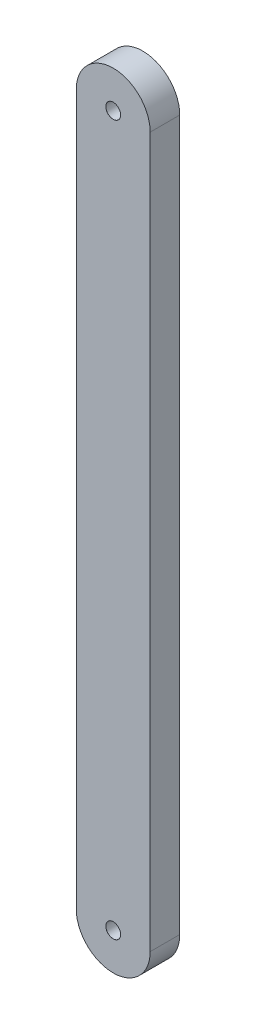
ISO-10303-21;
HEADER;
FILE_DESCRIPTION(('STEP AP214'),'2;1');
FILE_NAME('part.step','',(''),(''),'','','');
FILE_SCHEMA(('AUTOMOTIVE_DESIGN { 1 0 10303 214 1 1 1 1 }'));
ENDSEC;
DATA;
#1=APPLICATION_CONTEXT('core data for automotive mechanical design processes');
#2=APPLICATION_PROTOCOL_DEFINITION('international standard','automotive_design',2000,#1);
#3=PRODUCT_CONTEXT('',#1,'mechanical');
#4=PRODUCT('Part','Part','',(#3));
#5=PRODUCT_RELATED_PRODUCT_CATEGORY('part','',(#4));
#6=PRODUCT_DEFINITION_FORMATION('','',#4);
#7=PRODUCT_DEFINITION_CONTEXT('part definition',#1,'design');
#8=PRODUCT_DEFINITION('design','',#6,#7);
#9=PRODUCT_DEFINITION_SHAPE('','',#8);
#10=(LENGTH_UNIT() NAMED_UNIT(*) SI_UNIT(.MILLI.,.METRE.));
#11=(NAMED_UNIT(*) PLANE_ANGLE_UNIT() SI_UNIT($,.RADIAN.));
#12=(NAMED_UNIT(*) SI_UNIT($,.STERADIAN.) SOLID_ANGLE_UNIT());
#13=UNCERTAINTY_MEASURE_WITH_UNIT(LENGTH_MEASURE(1.E-05),#10,'distance_accuracy_value','');
#14=(GEOMETRIC_REPRESENTATION_CONTEXT(3) GLOBAL_UNCERTAINTY_ASSIGNED_CONTEXT((#13)) GLOBAL_UNIT_ASSIGNED_CONTEXT((#10,
#11,#12)) REPRESENTATION_CONTEXT('',''));
#15=CARTESIAN_POINT('',(0.,0.,0.));
#16=DIRECTION('',(0.,0.,1.));
#17=DIRECTION('',(1.,0.,0.));
#18=AXIS2_PLACEMENT_3D('',#15,#16,#17);
#19=CARTESIAN_POINT('',(25.,210.,11.2499996668486));
#20=DIRECTION('',(0.,0.,-1.));
#21=DIRECTION('',(-1.,0.,0.));
#22=AXIS2_PLACEMENT_3D('',#19,#20,#21);
#23=PLANE('',#22);
#24=CARTESIAN_POINT('',(25.,210.,11.2499996668486));
#25=DIRECTION('',(0.,0.,1.));
#26=DIRECTION('',(-1.,0.,0.));
#27=AXIS2_PLACEMENT_3D('',#24,#25,#26);
#28=CIRCLE('',#27,3.125);
#29=CARTESIAN_POINT('',(21.875,210.,11.2499996668486));
#30=VERTEX_POINT('',#29);
#31=CARTESIAN_POINT('',(28.125,210.,11.2499996668486));
#32=VERTEX_POINT('',#31);
#33=EDGE_CURVE('E88',#30,#32,#28,.T.);
#34=ORIENTED_EDGE('',*,*,#33,.T.);
#35=DIRECTION('',(0.,1.,0.));
#36=VECTOR('',#35,1.);
#37=CARTESIAN_POINT('',(28.125,270.,11.2499996668486));
#38=LINE('',#37,#36);
#39=CARTESIAN_POINT('',(28.125,270.,11.2499996668486));
#40=VERTEX_POINT('',#39);
#41=EDGE_CURVE('E83',#32,#40,#38,.T.);
#42=ORIENTED_EDGE('',*,*,#41,.T.);
#43=CARTESIAN_POINT('',(25.,270.,11.2499996668486));
#44=DIRECTION('',(0.,0.,1.));
#45=DIRECTION('',(-1.,0.,0.));
#46=AXIS2_PLACEMENT_3D('',#43,#44,#45);
#47=CIRCLE('',#46,3.125);
#48=CARTESIAN_POINT('',(21.875,270.,11.2499996668486));
#49=VERTEX_POINT('',#48);
#50=EDGE_CURVE('E86',#40,#49,#47,.T.);
#51=ORIENTED_EDGE('',*,*,#50,.T.);
#52=DIRECTION('',(0.,-1.,0.));
#53=VECTOR('',#52,1.);
#54=CARTESIAN_POINT('',(21.875,210.,11.2499996668486));
#55=LINE('',#54,#53);
#56=EDGE_CURVE('E53',#49,#30,#55,.T.);
#57=ORIENTED_EDGE('',*,*,#56,.T.);
#58=EDGE_LOOP('',(#34,#42,#51,#57));
#59=FACE_BOUND('',#58,.T.);
#60=CARTESIAN_POINT('',(25.,210.,11.2499996668486));
#61=DIRECTION('',(0.,0.,1.));
#62=DIRECTION('',(1.,0.,0.));
#63=AXIS2_PLACEMENT_3D('',#60,#61,#62);
#64=CIRCLE('',#63,0.628125);
#65=CARTESIAN_POINT('',(25.628125,210.,11.2499996668486));
#66=VERTEX_POINT('',#65);
#67=EDGE_CURVE('E119',#66,#66,#64,.T.);
#68=ORIENTED_EDGE('',*,*,#67,.F.);
#69=EDGE_LOOP('',(#68));
#70=FACE_BOUND('',#69,.T.);
#71=CARTESIAN_POINT('',(25.,270.,11.2499996668486));
#72=DIRECTION('',(0.,0.,1.));
#73=DIRECTION('',(1.,0.,0.));
#74=AXIS2_PLACEMENT_3D('',#71,#72,#73);
#75=CIRCLE('',#74,0.628125);
#76=CARTESIAN_POINT('',(25.628125,270.,11.2499996668486));
#77=VERTEX_POINT('',#76);
#78=EDGE_CURVE('E128',#77,#77,#75,.T.);
#79=ORIENTED_EDGE('',*,*,#78,.F.);
#80=EDGE_LOOP('',(#79));
#81=FACE_BOUND('',#80,.T.);
#82=ADVANCED_FACE('F36',(#59,#70,#81),#23,.F.);
#83=CARTESIAN_POINT('',(25.,210.,11.2499996668486));
#84=DIRECTION('',(0.,0.,-1.));
#85=DIRECTION('',(-1.,0.,0.));
#86=AXIS2_PLACEMENT_3D('',#83,#84,#85);
#87=CYLINDRICAL_SURFACE('',#86,3.125);
#88=CARTESIAN_POINT('',(25.,210.,8.74999966684864));
#89=DIRECTION('',(0.,0.,1.));
#90=DIRECTION('',(-1.,0.,0.));
#91=AXIS2_PLACEMENT_3D('',#88,#89,#90);
#92=CIRCLE('',#91,3.125);
#93=CARTESIAN_POINT('',(21.875,210.,8.74999966684864));
#94=VERTEX_POINT('',#93);
#95=CARTESIAN_POINT('',(28.125,210.,8.74999966684864));
#96=VERTEX_POINT('',#95);
#97=EDGE_CURVE('E100',#94,#96,#92,.T.);
#98=ORIENTED_EDGE('',*,*,#97,.T.);
#99=DIRECTION('',(0.,0.,-1.));
#100=VECTOR('',#99,1.);
#101=CARTESIAN_POINT('',(28.125,210.,11.2499996668486));
#102=LINE('',#101,#100);
#103=EDGE_CURVE('E11',#32,#96,#102,.T.);
#104=ORIENTED_EDGE('',*,*,#103,.F.);
#105=ORIENTED_EDGE('',*,*,#33,.F.);
#106=DIRECTION('',(0.,0.,-1.));
#107=VECTOR('',#106,1.);
#108=CARTESIAN_POINT('',(21.875,210.,11.2499996668486));
#109=LINE('',#108,#107);
#110=EDGE_CURVE('E96',#30,#94,#109,.T.);
#111=ORIENTED_EDGE('',*,*,#110,.T.);
#112=EDGE_LOOP('',(#98,#104,#105,#111));
#113=FACE_BOUND('',#112,.T.);
#114=ADVANCED_FACE('F38',(#113),#87,.T.);
#115=CARTESIAN_POINT('',(28.125,270.,11.2499996668486));
#116=DIRECTION('',(-1.,0.,0.));
#117=DIRECTION('',(0.,0.,1.));
#118=AXIS2_PLACEMENT_3D('',#115,#116,#117);
#119=PLANE('',#118);
#120=DIRECTION('',(0.,1.,0.));
#121=VECTOR('',#120,1.);
#122=CARTESIAN_POINT('',(28.125,270.,8.74999966684864));
#123=LINE('',#122,#121);
#124=CARTESIAN_POINT('',(28.125,270.,8.74999966684864));
#125=VERTEX_POINT('',#124);
#126=EDGE_CURVE('E92',#96,#125,#123,.T.);
#127=ORIENTED_EDGE('',*,*,#126,.T.);
#128=DIRECTION('',(0.,0.,-1.));
#129=VECTOR('',#128,1.);
#130=CARTESIAN_POINT('',(28.125,270.,11.2499996668486));
#131=LINE('',#130,#129);
#132=EDGE_CURVE('E45',#40,#125,#131,.T.);
#133=ORIENTED_EDGE('',*,*,#132,.F.);
#134=ORIENTED_EDGE('',*,*,#41,.F.);
#135=ORIENTED_EDGE('',*,*,#103,.T.);
#136=EDGE_LOOP('',(#127,#133,#134,#135));
#137=FACE_BOUND('',#136,.T.);
#138=ADVANCED_FACE('F91',(#137),#119,.F.);
#139=CARTESIAN_POINT('',(25.,270.,11.2499996668486));
#140=DIRECTION('',(0.,0.,-1.));
#141=DIRECTION('',(-1.,0.,0.));
#142=AXIS2_PLACEMENT_3D('',#139,#140,#141);
#143=CYLINDRICAL_SURFACE('',#142,3.125);
#144=CARTESIAN_POINT('',(25.,270.,8.74999966684864));
#145=DIRECTION('',(0.,0.,1.));
#146=DIRECTION('',(-1.,0.,0.));
#147=AXIS2_PLACEMENT_3D('',#144,#145,#146);
#148=CIRCLE('',#147,3.125);
#149=CARTESIAN_POINT('',(21.875,270.,8.74999966684864));
#150=VERTEX_POINT('',#149);
#151=EDGE_CURVE('E70',#125,#150,#148,.T.);
#152=ORIENTED_EDGE('',*,*,#151,.T.);
#153=DIRECTION('',(0.,0.,-1.));
#154=VECTOR('',#153,1.);
#155=CARTESIAN_POINT('',(21.875,270.,11.2499996668486));
#156=LINE('',#155,#154);
#157=EDGE_CURVE('E93',#49,#150,#156,.T.);
#158=ORIENTED_EDGE('',*,*,#157,.F.);
#159=ORIENTED_EDGE('',*,*,#50,.F.);
#160=ORIENTED_EDGE('',*,*,#132,.T.);
#161=EDGE_LOOP('',(#152,#158,#159,#160));
#162=FACE_BOUND('',#161,.T.);
#163=ADVANCED_FACE('F94',(#162),#143,.T.);
#164=CARTESIAN_POINT('',(21.875,210.,11.2499996668486));
#165=DIRECTION('',(1.,0.,0.));
#166=DIRECTION('',(0.,0.,-1.));
#167=AXIS2_PLACEMENT_3D('',#164,#165,#166);
#168=PLANE('',#167);
#169=DIRECTION('',(0.,-1.,0.));
#170=VECTOR('',#169,1.);
#171=CARTESIAN_POINT('',(21.875,210.,8.74999966684864));
#172=LINE('',#171,#170);
#173=EDGE_CURVE('E76',#150,#94,#172,.T.);
#174=ORIENTED_EDGE('',*,*,#173,.T.);
#175=ORIENTED_EDGE('',*,*,#110,.F.);
#176=ORIENTED_EDGE('',*,*,#56,.F.);
#177=ORIENTED_EDGE('',*,*,#157,.T.);
#178=EDGE_LOOP('',(#174,#175,#176,#177));
#179=FACE_BOUND('',#178,.T.);
#180=ADVANCED_FACE('F108',(#179),#168,.F.);
#181=CARTESIAN_POINT('',(25.,210.,8.74999966684864));
#182=DIRECTION('',(0.,0.,-1.));
#183=DIRECTION('',(-1.,0.,0.));
#184=AXIS2_PLACEMENT_3D('',#181,#182,#183);
#185=PLANE('',#184);
#186=CARTESIAN_POINT('',(25.,270.,8.74999966684864));
#187=DIRECTION('',(0.,0.,-1.));
#188=DIRECTION('',(-1.,0.,0.));
#189=AXIS2_PLACEMENT_3D('',#186,#187,#188);
#190=CIRCLE('',#189,0.624999999999999);
#191=CARTESIAN_POINT('',(24.375,270.,8.74999966684864));
#192=VERTEX_POINT('',#191);
#193=EDGE_CURVE('E122',#192,#192,#190,.T.);
#194=ORIENTED_EDGE('',*,*,#193,.F.);
#195=EDGE_LOOP('',(#194));
#196=FACE_BOUND('',#195,.T.);
#197=CARTESIAN_POINT('',(25.,210.,8.74999966684864));
#198=DIRECTION('',(0.,0.,-1.));
#199=DIRECTION('',(-1.,0.,0.));
#200=AXIS2_PLACEMENT_3D('',#197,#198,#199);
#201=CIRCLE('',#200,0.624999999999999);
#202=CARTESIAN_POINT('',(24.375,210.,8.74999966684864));
#203=VERTEX_POINT('',#202);
#204=EDGE_CURVE('E103',#203,#203,#201,.T.);
#205=ORIENTED_EDGE('',*,*,#204,.F.);
#206=EDGE_LOOP('',(#205));
#207=FACE_BOUND('',#206,.T.);
#208=ORIENTED_EDGE('',*,*,#97,.F.);
#209=ORIENTED_EDGE('',*,*,#173,.F.);
#210=ORIENTED_EDGE('',*,*,#151,.F.);
#211=ORIENTED_EDGE('',*,*,#126,.F.);
#212=EDGE_LOOP('',(#208,#209,#210,#211));
#213=FACE_BOUND('',#212,.T.);
#214=ADVANCED_FACE('F111',(#196,#207,#213),#185,.T.);
#215=CARTESIAN_POINT('',(25.,210.,11.2499996668486));
#216=DIRECTION('',(0.,0.,1.));
#217=DIRECTION('',(1.,0.,0.));
#218=AXIS2_PLACEMENT_3D('',#215,#216,#217);
#219=CYLINDRICAL_SURFACE('',#218,0.624999999999999);
#220=CARTESIAN_POINT('',(25.,210.,11.2468746668486));
#221=DIRECTION('',(0.,0.,1.));
#222=DIRECTION('',(1.,0.,0.));
#223=AXIS2_PLACEMENT_3D('',#220,#221,#222);
#224=CIRCLE('',#223,0.625);
#225=CARTESIAN_POINT('',(25.625,210.,11.2468746668486));
#226=VERTEX_POINT('',#225);
#227=EDGE_CURVE('E116',#226,#226,#224,.T.);
#228=ORIENTED_EDGE('',*,*,#227,.T.);
#229=EDGE_LOOP('',(#228));
#230=FACE_BOUND('',#229,.T.);
#231=ORIENTED_EDGE('',*,*,#204,.T.);
#232=EDGE_LOOP('',(#231));
#233=FACE_BOUND('',#232,.T.);
#234=ADVANCED_FACE('F141',(#230,#233),#219,.F.);
#235=CARTESIAN_POINT('',(25.,210.,11.2499996668486));
#236=DIRECTION('',(0.,0.,1.));
#237=DIRECTION('',(1.,0.,0.));
#238=AXIS2_PLACEMENT_3D('',#235,#236,#237);
#239=CONICAL_SURFACE('',#238,0.628125,0.785398163397587);
#240=ORIENTED_EDGE('',*,*,#227,.F.);
#241=EDGE_LOOP('',(#240));
#242=FACE_BOUND('',#241,.T.);
#243=ORIENTED_EDGE('',*,*,#67,.T.);
#244=EDGE_LOOP('',(#243));
#245=FACE_BOUND('',#244,.T.);
#246=ADVANCED_FACE('F172',(#242,#245),#239,.F.);
#247=CARTESIAN_POINT('',(25.,270.,11.2499996668486));
#248=DIRECTION('',(0.,0.,1.));
#249=DIRECTION('',(1.,0.,0.));
#250=AXIS2_PLACEMENT_3D('',#247,#248,#249);
#251=CYLINDRICAL_SURFACE('',#250,0.624999999999999);
#252=CARTESIAN_POINT('',(25.,270.,11.2468746668486));
#253=DIRECTION('',(0.,0.,1.));
#254=DIRECTION('',(1.,0.,0.));
#255=AXIS2_PLACEMENT_3D('',#252,#253,#254);
#256=CIRCLE('',#255,0.625);
#257=CARTESIAN_POINT('',(25.625,270.,11.2468746668486));
#258=VERTEX_POINT('',#257);
#259=EDGE_CURVE('E125',#258,#258,#256,.T.);
#260=ORIENTED_EDGE('',*,*,#259,.T.);
#261=EDGE_LOOP('',(#260));
#262=FACE_BOUND('',#261,.T.);
#263=ORIENTED_EDGE('',*,*,#193,.T.);
#264=EDGE_LOOP('',(#263));
#265=FACE_BOUND('',#264,.T.);
#266=ADVANCED_FACE('F179',(#262,#265),#251,.F.);
#267=CARTESIAN_POINT('',(25.,270.,11.2499996668486));
#268=DIRECTION('',(0.,0.,1.));
#269=DIRECTION('',(1.,0.,0.));
#270=AXIS2_PLACEMENT_3D('',#267,#268,#269);
#271=CONICAL_SURFACE('',#270,0.628125,0.785398163397587);
#272=ORIENTED_EDGE('',*,*,#259,.F.);
#273=EDGE_LOOP('',(#272));
#274=FACE_BOUND('',#273,.T.);
#275=ORIENTED_EDGE('',*,*,#78,.T.);
#276=EDGE_LOOP('',(#275));
#277=FACE_BOUND('',#276,.T.);
#278=ADVANCED_FACE('F132',(#274,#277),#271,.F.);
#279=CLOSED_SHELL('',(#82,#114,#138,#163,#180,#214,#234,#246,#266,#278));
#280=MANIFOLD_SOLID_BREP('B2',#279);
#281=ADVANCED_BREP_SHAPE_REPRESENTATION('',(#18,#280),#14);
#282=SHAPE_DEFINITION_REPRESENTATION(#9,#281);
ENDSEC;
END-ISO-10303-21;
